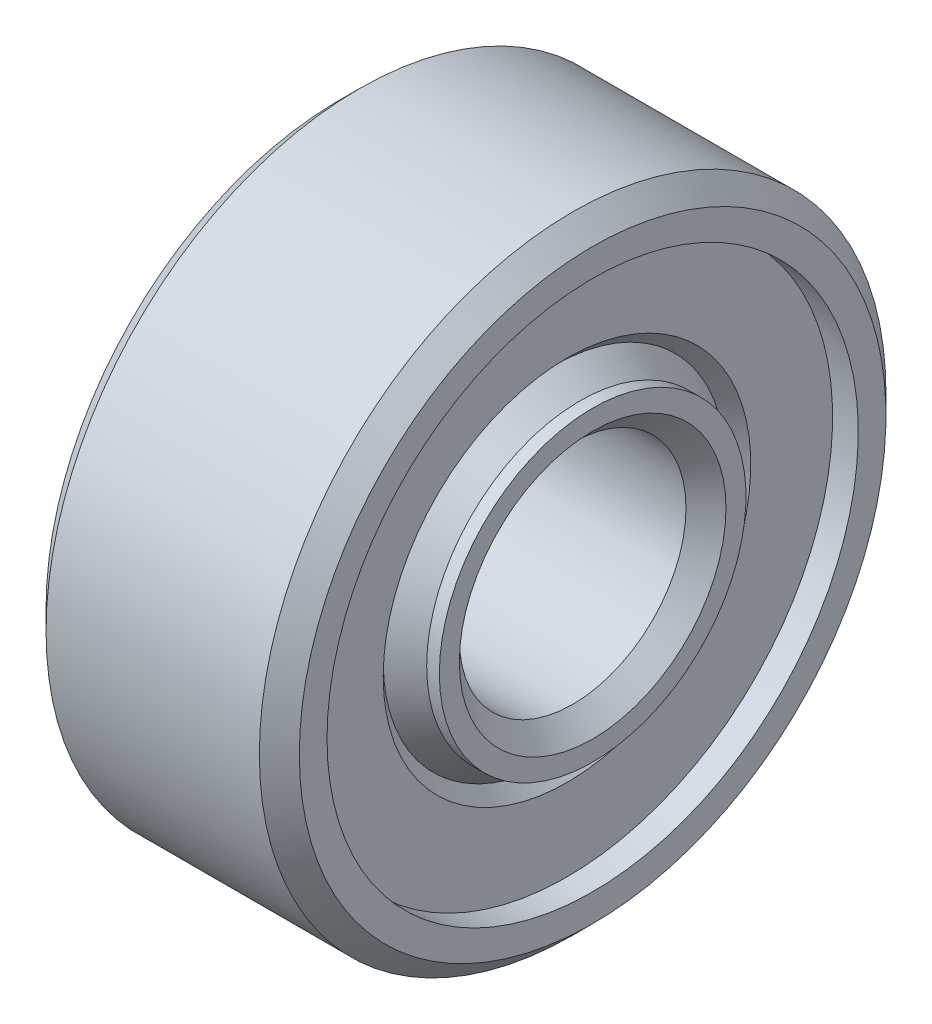
ISO-10303-21;
HEADER;
FILE_DESCRIPTION(('STEP AP214'),'2;1');
FILE_NAME('part.step','',(''),(''),'','','');
FILE_SCHEMA(('AUTOMOTIVE_DESIGN { 1 0 10303 214 1 1 1 1 }'));
ENDSEC;
DATA;
#1=APPLICATION_CONTEXT('core data for automotive mechanical design processes');
#2=APPLICATION_PROTOCOL_DEFINITION('international standard','automotive_design',2000,#1);
#3=PRODUCT_CONTEXT('',#1,'mechanical');
#4=PRODUCT('Part','Part','',(#3));
#5=PRODUCT_RELATED_PRODUCT_CATEGORY('part','',(#4));
#6=PRODUCT_DEFINITION_FORMATION('','',#4);
#7=PRODUCT_DEFINITION_CONTEXT('part definition',#1,'design');
#8=PRODUCT_DEFINITION('design','',#6,#7);
#9=PRODUCT_DEFINITION_SHAPE('','',#8);
#10=(LENGTH_UNIT() NAMED_UNIT(*) SI_UNIT(.MILLI.,.METRE.));
#11=(NAMED_UNIT(*) PLANE_ANGLE_UNIT() SI_UNIT($,.RADIAN.));
#12=(NAMED_UNIT(*) SI_UNIT($,.STERADIAN.) SOLID_ANGLE_UNIT());
#13=UNCERTAINTY_MEASURE_WITH_UNIT(LENGTH_MEASURE(1.E-05),#10,'distance_accuracy_value','');
#14=(GEOMETRIC_REPRESENTATION_CONTEXT(3) GLOBAL_UNCERTAINTY_ASSIGNED_CONTEXT((#13)) GLOBAL_UNIT_ASSIGNED_CONTEXT((#10,
#11,#12)) REPRESENTATION_CONTEXT('',''));
#15=CARTESIAN_POINT('',(0.,0.,0.));
#16=DIRECTION('',(0.,0.,1.));
#17=DIRECTION('',(1.,0.,0.));
#18=AXIS2_PLACEMENT_3D('',#15,#16,#17);
#19=CARTESIAN_POINT('',(16.125,-2.97038840172337,0.));
#20=DIRECTION('',(1.,0.,0.));
#21=DIRECTION('',(0.,0.,-1.));
#22=AXIS2_PLACEMENT_3D('',#19,#20,#21);
#23=PLANE('',#22);
#24=CARTESIAN_POINT('',(16.125,0.,0.));
#25=DIRECTION('',(-1.,0.,0.));
#26=DIRECTION('',(0.,0.,1.));
#27=AXIS2_PLACEMENT_3D('',#24,#25,#26);
#28=CIRCLE('',#27,12.8352601156069);
#29=CARTESIAN_POINT('',(16.125,0.,12.8352601156069));
#30=VERTEX_POINT('',#29);
#31=EDGE_CURVE('E11',#30,#30,#28,.T.);
#32=ORIENTED_EDGE('',*,*,#31,.F.);
#33=EDGE_LOOP('',(#32));
#34=FACE_BOUND('',#33,.T.);
#35=CARTESIAN_POINT('',(16.125,0.,0.));
#36=DIRECTION('',(-1.,0.,0.));
#37=DIRECTION('',(0.,0.,1.));
#38=AXIS2_PLACEMENT_3D('',#35,#36,#37);
#39=CIRCLE('',#38,19.925);
#40=CARTESIAN_POINT('',(16.125,0.,19.925));
#41=VERTEX_POINT('',#40);
#42=EDGE_CURVE('E61',#41,#41,#39,.T.);
#43=ORIENTED_EDGE('',*,*,#42,.T.);
#44=EDGE_LOOP('',(#43));
#45=FACE_BOUND('',#44,.T.);
#46=ADVANCED_FACE('F47',(#34,#45),#23,.F.);
#47=CARTESIAN_POINT('',(16.125,0.,0.));
#48=DIRECTION('',(1.,0.,0.));
#49=DIRECTION('',(0.,0.,-1.));
#50=AXIS2_PLACEMENT_3D('',#47,#48,#49);
#51=CONICAL_SURFACE('',#50,12.8352601156069,0.785398163397454);
#52=CARTESIAN_POINT('',(17.075,0.,0.));
#53=DIRECTION('',(-1.,0.,0.));
#54=DIRECTION('',(0.,0.,1.));
#55=AXIS2_PLACEMENT_3D('',#52,#53,#54);
#56=CIRCLE('',#55,13.785260115607);
#57=CARTESIAN_POINT('',(17.075,0.,13.785260115607));
#58=VERTEX_POINT('',#57);
#59=EDGE_CURVE('E53',#58,#58,#56,.T.);
#60=ORIENTED_EDGE('',*,*,#59,.F.);
#61=EDGE_LOOP('',(#60));
#62=FACE_BOUND('',#61,.T.);
#63=ORIENTED_EDGE('',*,*,#31,.T.);
#64=EDGE_LOOP('',(#63));
#65=FACE_BOUND('',#64,.T.);
#66=ADVANCED_FACE('F76',(#62,#65),#51,.F.);
#67=CARTESIAN_POINT('',(17.075,-2.97038840172337,0.));
#68=DIRECTION('',(1.,0.,0.));
#69=DIRECTION('',(0.,0.,-1.));
#70=AXIS2_PLACEMENT_3D('',#67,#68,#69);
#71=PLANE('',#70);
#72=ORIENTED_EDGE('',*,*,#59,.T.);
#73=EDGE_LOOP('',(#72));
#74=FACE_BOUND('',#73,.T.);
#75=CARTESIAN_POINT('',(17.075,0.,0.));
#76=DIRECTION('',(-1.,0.,0.));
#77=DIRECTION('',(0.,0.,1.));
#78=AXIS2_PLACEMENT_3D('',#75,#76,#77);
#79=CIRCLE('',#78,19.925);
#80=CARTESIAN_POINT('',(17.075,0.,19.925));
#81=VERTEX_POINT('',#80);
#82=EDGE_CURVE('E57',#81,#81,#79,.T.);
#83=ORIENTED_EDGE('',*,*,#82,.F.);
#84=EDGE_LOOP('',(#83));
#85=FACE_BOUND('',#84,.T.);
#86=ADVANCED_FACE('F70',(#74,#85),#71,.T.);
#87=CARTESIAN_POINT('',(0.,0.,0.));
#88=DIRECTION('',(-1.,0.,0.));
#89=DIRECTION('',(0.,0.,1.));
#90=AXIS2_PLACEMENT_3D('',#87,#88,#89);
#91=CYLINDRICAL_SURFACE('',#90,19.925);
#92=ORIENTED_EDGE('',*,*,#82,.T.);
#93=EDGE_LOOP('',(#92));
#94=FACE_BOUND('',#93,.T.);
#95=ORIENTED_EDGE('',*,*,#42,.F.);
#96=EDGE_LOOP('',(#95));
#97=FACE_BOUND('',#96,.T.);
#98=ADVANCED_FACE('F68',(#94,#97),#91,.T.);
#99=CLOSED_SHELL('',(#46,#66,#86,#98));
#100=MANIFOLD_SOLID_BREP('B2',#99);
#101=CARTESIAN_POINT('',(2.875,-2.97038840172337,0.));
#102=DIRECTION('',(1.,0.,0.));
#103=DIRECTION('',(0.,0.,-1.));
#104=AXIS2_PLACEMENT_3D('',#101,#102,#103);
#105=PLANE('',#104);
#106=CARTESIAN_POINT('',(2.875,0.,0.));
#107=DIRECTION('',(-1.,0.,0.));
#108=DIRECTION('',(0.,0.,1.));
#109=AXIS2_PLACEMENT_3D('',#106,#107,#108);
#110=CIRCLE('',#109,12.8352601156069);
#111=CARTESIAN_POINT('',(2.875,0.,12.8352601156069));
#112=VERTEX_POINT('',#111);
#113=EDGE_CURVE('E134',#112,#112,#110,.T.);
#114=ORIENTED_EDGE('',*,*,#113,.T.);
#115=EDGE_LOOP('',(#114));
#116=FACE_BOUND('',#115,.T.);
#117=CARTESIAN_POINT('',(2.875,0.,0.));
#118=DIRECTION('',(-1.,0.,0.));
#119=DIRECTION('',(0.,0.,1.));
#120=AXIS2_PLACEMENT_3D('',#117,#118,#119);
#121=CIRCLE('',#120,19.925);
#122=CARTESIAN_POINT('',(2.875,0.,19.925));
#123=VERTEX_POINT('',#122);
#124=EDGE_CURVE('E46',#123,#123,#121,.T.);
#125=ORIENTED_EDGE('',*,*,#124,.F.);
#126=EDGE_LOOP('',(#125));
#127=FACE_BOUND('',#126,.T.);
#128=ADVANCED_FACE('F120',(#116,#127),#105,.T.);
#129=CARTESIAN_POINT('',(0.,0.,0.));
#130=DIRECTION('',(-1.,0.,0.));
#131=DIRECTION('',(0.,0.,1.));
#132=AXIS2_PLACEMENT_3D('',#129,#130,#131);
#133=CYLINDRICAL_SURFACE('',#132,19.925);
#134=ORIENTED_EDGE('',*,*,#124,.T.);
#135=EDGE_LOOP('',(#134));
#136=FACE_BOUND('',#135,.T.);
#137=CARTESIAN_POINT('',(1.925,0.,0.));
#138=DIRECTION('',(-1.,0.,0.));
#139=DIRECTION('',(0.,0.,1.));
#140=AXIS2_PLACEMENT_3D('',#137,#138,#139);
#141=CIRCLE('',#140,19.925);
#142=CARTESIAN_POINT('',(1.925,0.,19.925));
#143=VERTEX_POINT('',#142);
#144=EDGE_CURVE('E126',#143,#143,#141,.T.);
#145=ORIENTED_EDGE('',*,*,#144,.F.);
#146=EDGE_LOOP('',(#145));
#147=FACE_BOUND('',#146,.T.);
#148=ADVANCED_FACE('F150',(#136,#147),#133,.T.);
#149=CARTESIAN_POINT('',(1.925,-2.97038840172337,0.));
#150=DIRECTION('',(1.,0.,0.));
#151=DIRECTION('',(0.,0.,-1.));
#152=AXIS2_PLACEMENT_3D('',#149,#150,#151);
#153=PLANE('',#152);
#154=CARTESIAN_POINT('',(1.925,0.,0.));
#155=DIRECTION('',(-1.,0.,0.));
#156=DIRECTION('',(0.,0.,1.));
#157=AXIS2_PLACEMENT_3D('',#154,#155,#156);
#158=CIRCLE('',#157,13.785260115607);
#159=CARTESIAN_POINT('',(1.925,0.,13.785260115607));
#160=VERTEX_POINT('',#159);
#161=EDGE_CURVE('E130',#160,#160,#158,.T.);
#162=ORIENTED_EDGE('',*,*,#161,.F.);
#163=EDGE_LOOP('',(#162));
#164=FACE_BOUND('',#163,.T.);
#165=ORIENTED_EDGE('',*,*,#144,.T.);
#166=EDGE_LOOP('',(#165));
#167=FACE_BOUND('',#166,.T.);
#168=ADVANCED_FACE('F145',(#164,#167),#153,.F.);
#169=CARTESIAN_POINT('',(1.925,0.,0.));
#170=DIRECTION('',(-1.,0.,0.));
#171=DIRECTION('',(0.,0.,1.));
#172=AXIS2_PLACEMENT_3D('',#169,#170,#171);
#173=CONICAL_SURFACE('',#172,13.785260115607,0.785398163397457);
#174=ORIENTED_EDGE('',*,*,#113,.F.);
#175=EDGE_LOOP('',(#174));
#176=FACE_BOUND('',#175,.T.);
#177=ORIENTED_EDGE('',*,*,#161,.T.);
#178=EDGE_LOOP('',(#177));
#179=FACE_BOUND('',#178,.T.);
#180=ADVANCED_FACE('F142',(#176,#179),#173,.F.);
#181=CLOSED_SHELL('',(#128,#148,#168,#180));
#182=MANIFOLD_SOLID_BREP('B6',#181);
#183=CARTESIAN_POINT('',(9.5,0.,0.));
#184=DIRECTION('',(-1.,0.,0.));
#185=DIRECTION('',(0.,0.,1.));
#186=AXIS2_PLACEMENT_3D('',#183,#184,#185);
#187=TOROIDAL_SURFACE('',#186,16.,3.75);
#188=CARTESIAN_POINT('',(9.5,0.,19.75));
#189=VERTEX_POINT('',#188);
#190=VERTEX_LOOP('',#189);
#191=FACE_BOUND('',#190,.T.);
#192=ADVANCED_FACE('F196',(#191),#187,.T.);
#193=CLOSED_SHELL('',(#192));
#194=MANIFOLD_SOLID_BREP('B41',#193);
#195=CARTESIAN_POINT('',(9.5,0.,0.));
#196=DIRECTION('',(-1.,0.,0.));
#197=DIRECTION('',(0.,0.,1.));
#198=AXIS2_PLACEMENT_3D('',#195,#196,#197);
#199=TOROIDAL_SURFACE('',#198,16.,3.75);
#200=CARTESIAN_POINT('',(12.2950849718747,0.,0.));
#201=DIRECTION('',(-1.,0.,0.));
#202=DIRECTION('',(0.,0.,1.));
#203=AXIS2_PLACEMENT_3D('',#200,#201,#202);
#204=CIRCLE('',#203,13.5);
#205=CARTESIAN_POINT('',(12.2950849718747,0.,13.5));
#206=VERTEX_POINT('',#205);
#207=EDGE_CURVE('E262',#206,#206,#204,.T.);
#208=ORIENTED_EDGE('',*,*,#207,.T.);
#209=EDGE_LOOP('',(#208));
#210=FACE_BOUND('',#209,.T.);
#211=CARTESIAN_POINT('',(6.70491502812526,0.,0.));
#212=DIRECTION('',(-1.,0.,0.));
#213=DIRECTION('',(0.,0.,1.));
#214=AXIS2_PLACEMENT_3D('',#211,#212,#213);
#215=CIRCLE('',#214,13.5);
#216=CARTESIAN_POINT('',(6.70491502812526,0.,13.5));
#217=VERTEX_POINT('',#216);
#218=EDGE_CURVE('E195',#217,#217,#215,.T.);
#219=ORIENTED_EDGE('',*,*,#218,.F.);
#220=EDGE_LOOP('',(#219));
#221=FACE_BOUND('',#220,.T.);
#222=ADVANCED_FACE('F222',(#210,#221),#199,.F.);
#223=CARTESIAN_POINT('',(0.,0.,0.));
#224=DIRECTION('',(-1.,0.,0.));
#225=DIRECTION('',(0.,0.,1.));
#226=AXIS2_PLACEMENT_3D('',#223,#224,#225);
#227=CYLINDRICAL_SURFACE('',#226,13.5);
#228=ORIENTED_EDGE('',*,*,#218,.T.);
#229=EDGE_LOOP('',(#228));
#230=FACE_BOUND('',#229,.T.);
#231=CARTESIAN_POINT('',(3.83333333333333,0.,0.));
#232=DIRECTION('',(-1.,0.,0.));
#233=DIRECTION('',(0.,0.,1.));
#234=AXIS2_PLACEMENT_3D('',#231,#232,#233);
#235=CIRCLE('',#234,13.5);
#236=CARTESIAN_POINT('',(3.83333333333333,0.,13.5));
#237=VERTEX_POINT('',#236);
#238=EDGE_CURVE('E228',#237,#237,#235,.T.);
#239=ORIENTED_EDGE('',*,*,#238,.F.);
#240=EDGE_LOOP('',(#239));
#241=FACE_BOUND('',#240,.T.);
#242=ADVANCED_FACE('F280',(#230,#241),#227,.T.);
#243=CARTESIAN_POINT('',(0.949999999999999,0.,0.));
#244=DIRECTION('',(1.,0.,0.));
#245=DIRECTION('',(0.,0.,-1.));
#246=AXIS2_PLACEMENT_3D('',#243,#244,#245);
#247=CONICAL_SURFACE('',#246,11.5,0.606445834884001);
#248=ORIENTED_EDGE('',*,*,#238,.T.);
#249=EDGE_LOOP('',(#248));
#250=FACE_BOUND('',#249,.T.);
#251=CARTESIAN_POINT('',(0.949999999999999,0.,0.));
#252=DIRECTION('',(-1.,0.,0.));
#253=DIRECTION('',(0.,0.,1.));
#254=AXIS2_PLACEMENT_3D('',#251,#252,#253);
#255=CIRCLE('',#254,11.5);
#256=CARTESIAN_POINT('',(0.949999999999999,0.,11.5));
#257=VERTEX_POINT('',#256);
#258=EDGE_CURVE('E232',#257,#257,#255,.T.);
#259=ORIENTED_EDGE('',*,*,#258,.F.);
#260=EDGE_LOOP('',(#259));
#261=FACE_BOUND('',#260,.T.);
#262=ADVANCED_FACE('F284',(#250,#261),#247,.T.);
#263=CARTESIAN_POINT('',(0.,0.,0.));
#264=DIRECTION('',(-1.,0.,0.));
#265=DIRECTION('',(0.,0.,1.));
#266=AXIS2_PLACEMENT_3D('',#263,#264,#265);
#267=CYLINDRICAL_SURFACE('',#266,11.5);
#268=ORIENTED_EDGE('',*,*,#258,.T.);
#269=EDGE_LOOP('',(#268));
#270=FACE_BOUND('',#269,.T.);
#271=CARTESIAN_POINT('',(0.,0.,0.));
#272=DIRECTION('',(-1.,0.,0.));
#273=DIRECTION('',(0.,0.,1.));
#274=AXIS2_PLACEMENT_3D('',#271,#272,#273);
#275=CIRCLE('',#274,11.5);
#276=CARTESIAN_POINT('',(0.,0.,11.5));
#277=VERTEX_POINT('',#276);
#278=EDGE_CURVE('E236',#277,#277,#275,.T.);
#279=ORIENTED_EDGE('',*,*,#278,.F.);
#280=EDGE_LOOP('',(#279));
#281=FACE_BOUND('',#280,.T.);
#282=ADVANCED_FACE('F288',(#270,#281),#267,.T.);
#283=CARTESIAN_POINT('',(0.,-2.97038840172337,0.));
#284=DIRECTION('',(-1.,0.,0.));
#285=DIRECTION('',(0.,0.,1.));
#286=AXIS2_PLACEMENT_3D('',#283,#284,#285);
#287=PLANE('',#286);
#288=ORIENTED_EDGE('',*,*,#278,.T.);
#289=EDGE_LOOP('',(#288));
#290=FACE_BOUND('',#289,.T.);
#291=CARTESIAN_POINT('',(0.,0.,0.));
#292=DIRECTION('',(-1.,0.,0.));
#293=DIRECTION('',(0.,0.,1.));
#294=AXIS2_PLACEMENT_3D('',#291,#292,#293);
#295=CIRCLE('',#294,9.99999999999999);
#296=CARTESIAN_POINT('',(0.,0.,9.99999999999999));
#297=VERTEX_POINT('',#296);
#298=EDGE_CURVE('E241',#297,#297,#295,.T.);
#299=ORIENTED_EDGE('',*,*,#298,.F.);
#300=EDGE_LOOP('',(#299));
#301=FACE_BOUND('',#300,.T.);
#302=ADVANCED_FACE('F294',(#290,#301),#287,.T.);
#303=CARTESIAN_POINT('',(0.,0.,0.));
#304=DIRECTION('',(-1.,0.,0.));
#305=DIRECTION('',(0.,0.,1.));
#306=AXIS2_PLACEMENT_3D('',#303,#304,#305);
#307=CONICAL_SURFACE('',#306,9.99999999999999,0.785398163397447);
#308=CARTESIAN_POINT('',(1.5,0.,0.));
#309=DIRECTION('',(-1.,0.,0.));
#310=DIRECTION('',(0.,0.,1.));
#311=AXIS2_PLACEMENT_3D('',#308,#309,#310);
#312=CIRCLE('',#311,8.5);
#313=CARTESIAN_POINT('',(1.5,0.,8.5));
#314=VERTEX_POINT('',#313);
#315=EDGE_CURVE('E244',#314,#314,#312,.T.);
#316=ORIENTED_EDGE('',*,*,#315,.F.);
#317=EDGE_LOOP('',(#316));
#318=FACE_BOUND('',#317,.T.);
#319=ORIENTED_EDGE('',*,*,#298,.T.);
#320=EDGE_LOOP('',(#319));
#321=FACE_BOUND('',#320,.T.);
#322=ADVANCED_FACE('F298',(#318,#321),#307,.F.);
#323=CARTESIAN_POINT('',(0.,0.,0.));
#324=DIRECTION('',(-1.,0.,0.));
#325=DIRECTION('',(0.,0.,1.));
#326=AXIS2_PLACEMENT_3D('',#323,#324,#325);
#327=CYLINDRICAL_SURFACE('',#326,8.5);
#328=CARTESIAN_POINT('',(17.5,0.,0.));
#329=DIRECTION('',(-1.,0.,0.));
#330=DIRECTION('',(0.,0.,1.));
#331=AXIS2_PLACEMENT_3D('',#328,#329,#330);
#332=CIRCLE('',#331,8.5);
#333=CARTESIAN_POINT('',(17.5,0.,8.5));
#334=VERTEX_POINT('',#333);
#335=EDGE_CURVE('E247',#334,#334,#332,.T.);
#336=ORIENTED_EDGE('',*,*,#335,.F.);
#337=EDGE_LOOP('',(#336));
#338=FACE_BOUND('',#337,.T.);
#339=ORIENTED_EDGE('',*,*,#315,.T.);
#340=EDGE_LOOP('',(#339));
#341=FACE_BOUND('',#340,.T.);
#342=ADVANCED_FACE('F302',(#338,#341),#327,.F.);
#343=CARTESIAN_POINT('',(17.5,0.,0.));
#344=DIRECTION('',(1.,0.,0.));
#345=DIRECTION('',(0.,0.,-1.));
#346=AXIS2_PLACEMENT_3D('',#343,#344,#345);
#347=CONICAL_SURFACE('',#346,8.5,0.78539816339745);
#348=CARTESIAN_POINT('',(19.,0.,0.));
#349=DIRECTION('',(-1.,0.,0.));
#350=DIRECTION('',(0.,0.,1.));
#351=AXIS2_PLACEMENT_3D('',#348,#349,#350);
#352=CIRCLE('',#351,10.);
#353=CARTESIAN_POINT('',(19.,0.,10.));
#354=VERTEX_POINT('',#353);
#355=EDGE_CURVE('E250',#354,#354,#352,.T.);
#356=ORIENTED_EDGE('',*,*,#355,.F.);
#357=EDGE_LOOP('',(#356));
#358=FACE_BOUND('',#357,.T.);
#359=ORIENTED_EDGE('',*,*,#335,.T.);
#360=EDGE_LOOP('',(#359));
#361=FACE_BOUND('',#360,.T.);
#362=ADVANCED_FACE('F306',(#358,#361),#347,.F.);
#363=CARTESIAN_POINT('',(19.,-2.97038840172337,0.));
#364=DIRECTION('',(-1.,0.,0.));
#365=DIRECTION('',(0.,0.,1.));
#366=AXIS2_PLACEMENT_3D('',#363,#364,#365);
#367=PLANE('',#366);
#368=CARTESIAN_POINT('',(19.,0.,0.));
#369=DIRECTION('',(-1.,0.,0.));
#370=DIRECTION('',(0.,0.,1.));
#371=AXIS2_PLACEMENT_3D('',#368,#369,#370);
#372=CIRCLE('',#371,11.5);
#373=CARTESIAN_POINT('',(19.,0.,11.5));
#374=VERTEX_POINT('',#373);
#375=EDGE_CURVE('E253',#374,#374,#372,.T.);
#376=ORIENTED_EDGE('',*,*,#375,.F.);
#377=EDGE_LOOP('',(#376));
#378=FACE_BOUND('',#377,.T.);
#379=ORIENTED_EDGE('',*,*,#355,.T.);
#380=EDGE_LOOP('',(#379));
#381=FACE_BOUND('',#380,.T.);
#382=ADVANCED_FACE('F310',(#378,#381),#367,.F.);
#383=CARTESIAN_POINT('',(0.,0.,0.));
#384=DIRECTION('',(-1.,0.,0.));
#385=DIRECTION('',(0.,0.,1.));
#386=AXIS2_PLACEMENT_3D('',#383,#384,#385);
#387=CYLINDRICAL_SURFACE('',#386,11.5);
#388=ORIENTED_EDGE('',*,*,#375,.T.);
#389=EDGE_LOOP('',(#388));
#390=FACE_BOUND('',#389,.T.);
#391=CARTESIAN_POINT('',(18.05,0.,0.));
#392=DIRECTION('',(-1.,0.,0.));
#393=DIRECTION('',(0.,0.,1.));
#394=AXIS2_PLACEMENT_3D('',#391,#392,#393);
#395=CIRCLE('',#394,11.5);
#396=CARTESIAN_POINT('',(18.05,0.,11.5));
#397=VERTEX_POINT('',#396);
#398=EDGE_CURVE('E256',#397,#397,#395,.T.);
#399=ORIENTED_EDGE('',*,*,#398,.F.);
#400=EDGE_LOOP('',(#399));
#401=FACE_BOUND('',#400,.T.);
#402=ADVANCED_FACE('F276',(#390,#401),#387,.T.);
#403=CARTESIAN_POINT('',(15.1666666666667,0.,0.));
#404=DIRECTION('',(-1.,0.,0.));
#405=DIRECTION('',(0.,0.,1.));
#406=AXIS2_PLACEMENT_3D('',#403,#404,#405);
#407=CONICAL_SURFACE('',#406,13.5,0.606445834884);
#408=ORIENTED_EDGE('',*,*,#398,.T.);
#409=EDGE_LOOP('',(#408));
#410=FACE_BOUND('',#409,.T.);
#411=CARTESIAN_POINT('',(15.1666666666667,0.,0.));
#412=DIRECTION('',(-1.,0.,0.));
#413=DIRECTION('',(0.,0.,1.));
#414=AXIS2_PLACEMENT_3D('',#411,#412,#413);
#415=CIRCLE('',#414,13.5);
#416=CARTESIAN_POINT('',(15.1666666666667,0.,13.5));
#417=VERTEX_POINT('',#416);
#418=EDGE_CURVE('E259',#417,#417,#415,.T.);
#419=ORIENTED_EDGE('',*,*,#418,.F.);
#420=EDGE_LOOP('',(#419));
#421=FACE_BOUND('',#420,.T.);
#422=ADVANCED_FACE('F270',(#410,#421),#407,.T.);
#423=CARTESIAN_POINT('',(0.,0.,0.));
#424=DIRECTION('',(-1.,0.,0.));
#425=DIRECTION('',(0.,0.,1.));
#426=AXIS2_PLACEMENT_3D('',#423,#424,#425);
#427=CYLINDRICAL_SURFACE('',#426,13.5);
#428=ORIENTED_EDGE('',*,*,#418,.T.);
#429=EDGE_LOOP('',(#428));
#430=FACE_BOUND('',#429,.T.);
#431=ORIENTED_EDGE('',*,*,#207,.F.);
#432=EDGE_LOOP('',(#431));
#433=FACE_BOUND('',#432,.T.);
#434=ADVANCED_FACE('F268',(#430,#433),#427,.T.);
#435=CLOSED_SHELL('',(#222,#242,#262,#282,#302,#322,#342,#362,#382,#402,#422,#434));
#436=MANIFOLD_SOLID_BREP('B116',#435);
#437=CARTESIAN_POINT('',(9.5,0.,0.));
#438=DIRECTION('',(-1.,0.,0.));
#439=DIRECTION('',(0.,0.,1.));
#440=AXIS2_PLACEMENT_3D('',#437,#438,#439);
#441=TOROIDAL_SURFACE('',#440,16.,3.75);
#442=CARTESIAN_POINT('',(6.70491502812526,0.,0.));
#443=DIRECTION('',(-1.,0.,0.));
#444=DIRECTION('',(0.,0.,1.));
#445=AXIS2_PLACEMENT_3D('',#442,#443,#444);
#446=CIRCLE('',#445,18.5);
#447=CARTESIAN_POINT('',(6.70491502812526,0.,18.5));
#448=VERTEX_POINT('',#447);
#449=EDGE_CURVE('E454',#448,#448,#446,.T.);
#450=ORIENTED_EDGE('',*,*,#449,.T.);
#451=EDGE_LOOP('',(#450));
#452=FACE_BOUND('',#451,.T.);
#453=CARTESIAN_POINT('',(12.2950849718747,0.,0.));
#454=DIRECTION('',(-1.,0.,0.));
#455=DIRECTION('',(0.,0.,1.));
#456=AXIS2_PLACEMENT_3D('',#453,#454,#455);
#457=CIRCLE('',#456,18.5);
#458=CARTESIAN_POINT('',(12.2950849718747,0.,18.5));
#459=VERTEX_POINT('',#458);
#460=EDGE_CURVE('E221',#459,#459,#457,.T.);
#461=ORIENTED_EDGE('',*,*,#460,.F.);
#462=EDGE_LOOP('',(#461));
#463=FACE_BOUND('',#462,.T.);
#464=ADVANCED_FACE('F413',(#452,#463),#441,.F.);
#465=CARTESIAN_POINT('',(0.,0.,0.));
#466=DIRECTION('',(-1.,0.,0.));
#467=DIRECTION('',(0.,0.,1.));
#468=AXIS2_PLACEMENT_3D('',#465,#466,#467);
#469=CYLINDRICAL_SURFACE('',#468,18.5);
#470=CARTESIAN_POINT('',(16.125,0.,0.));
#471=DIRECTION('',(-1.,0.,0.));
#472=DIRECTION('',(0.,0.,1.));
#473=AXIS2_PLACEMENT_3D('',#470,#471,#472);
#474=CIRCLE('',#473,18.5);
#475=CARTESIAN_POINT('',(16.125,0.,18.5));
#476=VERTEX_POINT('',#475);
#477=EDGE_CURVE('E419',#476,#476,#474,.T.);
#478=ORIENTED_EDGE('',*,*,#477,.F.);
#479=EDGE_LOOP('',(#478));
#480=FACE_BOUND('',#479,.T.);
#481=ORIENTED_EDGE('',*,*,#460,.T.);
#482=EDGE_LOOP('',(#481));
#483=FACE_BOUND('',#482,.T.);
#484=ADVANCED_FACE('F490',(#480,#483),#469,.F.);
#485=CARTESIAN_POINT('',(16.125,-2.97038840172337,0.));
#486=DIRECTION('',(1.,0.,0.));
#487=DIRECTION('',(0.,0.,-1.));
#488=AXIS2_PLACEMENT_3D('',#485,#486,#487);
#489=PLANE('',#488);
#490=ORIENTED_EDGE('',*,*,#477,.T.);
#491=EDGE_LOOP('',(#490));
#492=FACE_BOUND('',#491,.T.);
#493=CARTESIAN_POINT('',(16.125,0.,0.));
#494=DIRECTION('',(-1.,0.,0.));
#495=DIRECTION('',(0.,0.,1.));
#496=AXIS2_PLACEMENT_3D('',#493,#494,#495);
#497=CIRCLE('',#496,19.925);
#498=CARTESIAN_POINT('',(16.125,0.,19.925));
#499=VERTEX_POINT('',#498);
#500=EDGE_CURVE('E423',#499,#499,#497,.T.);
#501=ORIENTED_EDGE('',*,*,#500,.F.);
#502=EDGE_LOOP('',(#501));
#503=FACE_BOUND('',#502,.T.);
#504=ADVANCED_FACE('F494',(#492,#503),#489,.T.);
#505=CARTESIAN_POINT('',(0.,0.,0.));
#506=DIRECTION('',(-1.,0.,0.));
#507=DIRECTION('',(0.,0.,1.));
#508=AXIS2_PLACEMENT_3D('',#505,#506,#507);
#509=CYLINDRICAL_SURFACE('',#508,19.925);
#510=CARTESIAN_POINT('',(19.,0.,0.));
#511=DIRECTION('',(-1.,0.,0.));
#512=DIRECTION('',(0.,0.,1.));
#513=AXIS2_PLACEMENT_3D('',#510,#511,#512);
#514=CIRCLE('',#513,19.925);
#515=CARTESIAN_POINT('',(19.,0.,19.925));
#516=VERTEX_POINT('',#515);
#517=EDGE_CURVE('E427',#516,#516,#514,.T.);
#518=ORIENTED_EDGE('',*,*,#517,.F.);
#519=EDGE_LOOP('',(#518));
#520=FACE_BOUND('',#519,.T.);
#521=ORIENTED_EDGE('',*,*,#500,.T.);
#522=EDGE_LOOP('',(#521));
#523=FACE_BOUND('',#522,.T.);
#524=ADVANCED_FACE('F499',(#520,#523),#509,.F.);
#525=CARTESIAN_POINT('',(19.,-2.97038840172338,0.));
#526=DIRECTION('',(-1.,0.,0.));
#527=DIRECTION('',(0.,0.,1.));
#528=AXIS2_PLACEMENT_3D('',#525,#526,#527);
#529=PLANE('',#528);
#530=CARTESIAN_POINT('',(19.,0.,0.));
#531=DIRECTION('',(-1.,0.,0.));
#532=DIRECTION('',(0.,0.,1.));
#533=AXIS2_PLACEMENT_3D('',#530,#531,#532);
#534=CIRCLE('',#533,22.);
#535=CARTESIAN_POINT('',(19.,0.,22.));
#536=VERTEX_POINT('',#535);
#537=EDGE_CURVE('E432',#536,#536,#534,.T.);
#538=ORIENTED_EDGE('',*,*,#537,.F.);
#539=EDGE_LOOP('',(#538));
#540=FACE_BOUND('',#539,.T.);
#541=ORIENTED_EDGE('',*,*,#517,.T.);
#542=EDGE_LOOP('',(#541));
#543=FACE_BOUND('',#542,.T.);
#544=ADVANCED_FACE('F504',(#540,#543),#529,.F.);
#545=CARTESIAN_POINT('',(17.5,0.,0.));
#546=DIRECTION('',(-1.,0.,0.));
#547=DIRECTION('',(0.,0.,1.));
#548=AXIS2_PLACEMENT_3D('',#545,#546,#547);
#549=CONICAL_SURFACE('',#548,23.5,0.785398163397446);
#550=ORIENTED_EDGE('',*,*,#537,.T.);
#551=EDGE_LOOP('',(#550));
#552=FACE_BOUND('',#551,.T.);
#553=CARTESIAN_POINT('',(17.5,0.,0.));
#554=DIRECTION('',(-1.,0.,0.));
#555=DIRECTION('',(0.,0.,1.));
#556=AXIS2_PLACEMENT_3D('',#553,#554,#555);
#557=CIRCLE('',#556,23.5);
#558=CARTESIAN_POINT('',(17.5,0.,23.5));
#559=VERTEX_POINT('',#558);
#560=EDGE_CURVE('E435',#559,#559,#557,.T.);
#561=ORIENTED_EDGE('',*,*,#560,.F.);
#562=EDGE_LOOP('',(#561));
#563=FACE_BOUND('',#562,.T.);
#564=ADVANCED_FACE('F508',(#552,#563),#549,.T.);
#565=CARTESIAN_POINT('',(0.,0.,0.));
#566=DIRECTION('',(-1.,0.,0.));
#567=DIRECTION('',(0.,0.,1.));
#568=AXIS2_PLACEMENT_3D('',#565,#566,#567);
#569=CYLINDRICAL_SURFACE('',#568,23.5);
#570=ORIENTED_EDGE('',*,*,#560,.T.);
#571=EDGE_LOOP('',(#570));
#572=FACE_BOUND('',#571,.T.);
#573=CARTESIAN_POINT('',(1.50000000000003,0.,0.));
#574=DIRECTION('',(-1.,0.,0.));
#575=DIRECTION('',(0.,0.,1.));
#576=AXIS2_PLACEMENT_3D('',#573,#574,#575);
#577=CIRCLE('',#576,23.5);
#578=CARTESIAN_POINT('',(1.50000000000003,0.,23.5));
#579=VERTEX_POINT('',#578);
#580=EDGE_CURVE('E438',#579,#579,#577,.T.);
#581=ORIENTED_EDGE('',*,*,#580,.F.);
#582=EDGE_LOOP('',(#581));
#583=FACE_BOUND('',#582,.T.);
#584=ADVANCED_FACE('F486',(#572,#583),#569,.T.);
#585=CARTESIAN_POINT('',(0.,0.,0.));
#586=DIRECTION('',(1.,0.,0.));
#587=DIRECTION('',(0.,0.,-1.));
#588=AXIS2_PLACEMENT_3D('',#585,#586,#587);
#589=CONICAL_SURFACE('',#588,22.,0.785398163397445);
#590=ORIENTED_EDGE('',*,*,#580,.T.);
#591=EDGE_LOOP('',(#590));
#592=FACE_BOUND('',#591,.T.);
#593=CARTESIAN_POINT('',(0.,0.,0.));
#594=DIRECTION('',(-1.,0.,0.));
#595=DIRECTION('',(0.,0.,1.));
#596=AXIS2_PLACEMENT_3D('',#593,#594,#595);
#597=CIRCLE('',#596,22.);
#598=CARTESIAN_POINT('',(0.,0.,22.));
#599=VERTEX_POINT('',#598);
#600=EDGE_CURVE('E442',#599,#599,#597,.T.);
#601=ORIENTED_EDGE('',*,*,#600,.F.);
#602=EDGE_LOOP('',(#601));
#603=FACE_BOUND('',#602,.T.);
#604=ADVANCED_FACE('F480',(#592,#603),#589,.T.);
#605=CARTESIAN_POINT('',(0.,-2.97038840172337,0.));
#606=DIRECTION('',(-1.,0.,0.));
#607=DIRECTION('',(0.,0.,1.));
#608=AXIS2_PLACEMENT_3D('',#605,#606,#607);
#609=PLANE('',#608);
#610=ORIENTED_EDGE('',*,*,#600,.T.);
#611=EDGE_LOOP('',(#610));
#612=FACE_BOUND('',#611,.T.);
#613=CARTESIAN_POINT('',(0.,0.,0.));
#614=DIRECTION('',(-1.,0.,0.));
#615=DIRECTION('',(0.,0.,1.));
#616=AXIS2_PLACEMENT_3D('',#613,#614,#615);
#617=CIRCLE('',#616,19.925);
#618=CARTESIAN_POINT('',(0.,0.,19.925));
#619=VERTEX_POINT('',#618);
#620=EDGE_CURVE('E445',#619,#619,#617,.T.);
#621=ORIENTED_EDGE('',*,*,#620,.F.);
#622=EDGE_LOOP('',(#621));
#623=FACE_BOUND('',#622,.T.);
#624=ADVANCED_FACE('F475',(#612,#623),#609,.T.);
#625=CARTESIAN_POINT('',(0.,0.,0.));
#626=DIRECTION('',(-1.,0.,0.));
#627=DIRECTION('',(0.,0.,1.));
#628=AXIS2_PLACEMENT_3D('',#625,#626,#627);
#629=CYLINDRICAL_SURFACE('',#628,19.925);
#630=CARTESIAN_POINT('',(2.875,0.,0.));
#631=DIRECTION('',(-1.,0.,0.));
#632=DIRECTION('',(0.,0.,1.));
#633=AXIS2_PLACEMENT_3D('',#630,#631,#632);
#634=CIRCLE('',#633,19.925);
#635=CARTESIAN_POINT('',(2.875,0.,19.925));
#636=VERTEX_POINT('',#635);
#637=EDGE_CURVE('E448',#636,#636,#634,.T.);
#638=ORIENTED_EDGE('',*,*,#637,.F.);
#639=EDGE_LOOP('',(#638));
#640=FACE_BOUND('',#639,.T.);
#641=ORIENTED_EDGE('',*,*,#620,.T.);
#642=EDGE_LOOP('',(#641));
#643=FACE_BOUND('',#642,.T.);
#644=ADVANCED_FACE('F469',(#640,#643),#629,.F.);
#645=CARTESIAN_POINT('',(2.875,-2.97038840172337,0.));
#646=DIRECTION('',(1.,0.,0.));
#647=DIRECTION('',(0.,0.,-1.));
#648=AXIS2_PLACEMENT_3D('',#645,#646,#647);
#649=PLANE('',#648);
#650=CARTESIAN_POINT('',(2.875,0.,0.));
#651=DIRECTION('',(-1.,0.,0.));
#652=DIRECTION('',(0.,0.,1.));
#653=AXIS2_PLACEMENT_3D('',#650,#651,#652);
#654=CIRCLE('',#653,18.5);
#655=CARTESIAN_POINT('',(2.875,0.,18.5));
#656=VERTEX_POINT('',#655);
#657=EDGE_CURVE('E451',#656,#656,#654,.T.);
#658=ORIENTED_EDGE('',*,*,#657,.F.);
#659=EDGE_LOOP('',(#658));
#660=FACE_BOUND('',#659,.T.);
#661=ORIENTED_EDGE('',*,*,#637,.T.);
#662=EDGE_LOOP('',(#661));
#663=FACE_BOUND('',#662,.T.);
#664=ADVANCED_FACE('F463',(#660,#663),#649,.F.);
#665=CARTESIAN_POINT('',(0.,0.,0.));
#666=DIRECTION('',(-1.,0.,0.));
#667=DIRECTION('',(0.,0.,1.));
#668=AXIS2_PLACEMENT_3D('',#665,#666,#667);
#669=CYLINDRICAL_SURFACE('',#668,18.5);
#670=ORIENTED_EDGE('',*,*,#449,.F.);
#671=EDGE_LOOP('',(#670));
#672=FACE_BOUND('',#671,.T.);
#673=ORIENTED_EDGE('',*,*,#657,.T.);
#674=EDGE_LOOP('',(#673));
#675=FACE_BOUND('',#674,.T.);
#676=ADVANCED_FACE('F460',(#672,#675),#669,.F.);
#677=CLOSED_SHELL('',(#464,#484,#504,#524,#544,#564,#584,#604,#624,#644,#664,#676));
#678=MANIFOLD_SOLID_BREP('B190',#677);
#679=ADVANCED_BREP_SHAPE_REPRESENTATION('',(#18,#100,#182,#194,#436,#678),#14);
#680=SHAPE_DEFINITION_REPRESENTATION(#9,#679);
ENDSEC;
END-ISO-10303-21;
